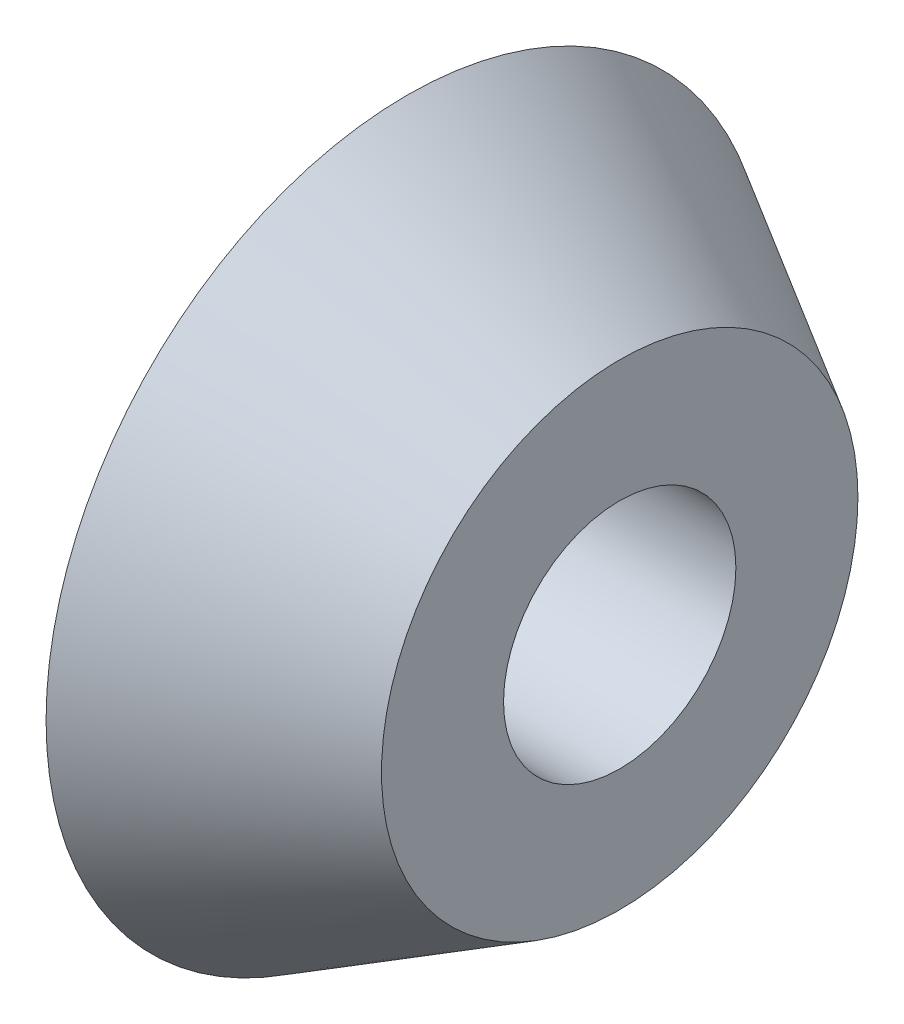
ISO-10303-21;
HEADER;
FILE_DESCRIPTION(('STEP AP214'),'2;1');
FILE_NAME('part.step','',(''),(''),'','','');
FILE_SCHEMA(('AUTOMOTIVE_DESIGN { 1 0 10303 214 1 1 1 1 }'));
ENDSEC;
DATA;
#1=APPLICATION_CONTEXT('core data for automotive mechanical design processes');
#2=APPLICATION_PROTOCOL_DEFINITION('international standard','automotive_design',2000,#1);
#3=PRODUCT_CONTEXT('',#1,'mechanical');
#4=PRODUCT('Part','Part','',(#3));
#5=PRODUCT_RELATED_PRODUCT_CATEGORY('part','',(#4));
#6=PRODUCT_DEFINITION_FORMATION('','',#4);
#7=PRODUCT_DEFINITION_CONTEXT('part definition',#1,'design');
#8=PRODUCT_DEFINITION('design','',#6,#7);
#9=PRODUCT_DEFINITION_SHAPE('','',#8);
#10=(LENGTH_UNIT() NAMED_UNIT(*) SI_UNIT(.MILLI.,.METRE.));
#11=(NAMED_UNIT(*) PLANE_ANGLE_UNIT() SI_UNIT($,.RADIAN.));
#12=(NAMED_UNIT(*) SI_UNIT($,.STERADIAN.) SOLID_ANGLE_UNIT());
#13=UNCERTAINTY_MEASURE_WITH_UNIT(LENGTH_MEASURE(1.E-05),#10,'distance_accuracy_value','');
#14=(GEOMETRIC_REPRESENTATION_CONTEXT(3) GLOBAL_UNCERTAINTY_ASSIGNED_CONTEXT((#13)) GLOBAL_UNIT_ASSIGNED_CONTEXT((#10,
#11,#12)) REPRESENTATION_CONTEXT('',''));
#15=CARTESIAN_POINT('',(0.,0.,0.));
#16=DIRECTION('',(0.,0.,1.));
#17=DIRECTION('',(1.,0.,0.));
#18=AXIS2_PLACEMENT_3D('',#15,#16,#17);
#19=CARTESIAN_POINT('',(4.41320981879205,15.494,0.));
#20=DIRECTION('',(1.,0.,0.));
#21=DIRECTION('',(0.,0.,1.));
#22=AXIS2_PLACEMENT_3D('',#19,#20,#21);
#23=PLANE('',#22);
#24=CARTESIAN_POINT('',(4.41320981879205,0.,0.));
#25=DIRECTION('',(1.,0.,0.));
#26=DIRECTION('',(0.,0.,-1.));
#27=AXIS2_PLACEMENT_3D('',#24,#25,#26);
#28=CIRCLE('',#27,8.0518);
#29=CARTESIAN_POINT('',(4.41320981879205,0.,-8.0518));
#30=VERTEX_POINT('',#29);
#31=EDGE_CURVE('E10',#30,#30,#28,.T.);
#32=ORIENTED_EDGE('',*,*,#31,.T.);
#33=EDGE_LOOP('',(#32));
#34=FACE_BOUND('',#33,.T.);
#35=CARTESIAN_POINT('',(4.41320981879205,0.,0.));
#36=DIRECTION('',(1.,0.,0.));
#37=DIRECTION('',(0.,0.,-1.));
#38=AXIS2_PLACEMENT_3D('',#35,#36,#37);
#39=CIRCLE('',#38,15.494);
#40=CARTESIAN_POINT('',(4.41320981879205,0.,-15.494));
#41=VERTEX_POINT('',#40);
#42=EDGE_CURVE('E57',#41,#41,#39,.T.);
#43=ORIENTED_EDGE('',*,*,#42,.F.);
#44=EDGE_LOOP('',(#43));
#45=FACE_BOUND('',#44,.T.);
#46=ADVANCED_FACE('F32',(#34,#45),#23,.F.);
#47=CARTESIAN_POINT('',(0.,0.,0.));
#48=DIRECTION('',(-1.,0.,0.));
#49=DIRECTION('',(0.,0.,-1.));
#50=AXIS2_PLACEMENT_3D('',#47,#48,#49);
#51=CYLINDRICAL_SURFACE('',#50,8.0518);
#52=CARTESIAN_POINT('',(25.5012301403958,0.,0.));
#53=DIRECTION('',(1.,0.,0.));
#54=DIRECTION('',(0.,0.,-1.));
#55=AXIS2_PLACEMENT_3D('',#52,#53,#54);
#56=CIRCLE('',#55,8.0518);
#57=CARTESIAN_POINT('',(25.5012301403958,0.,-8.0518));
#58=VERTEX_POINT('',#57);
#59=EDGE_CURVE('E38',#58,#58,#56,.T.);
#60=ORIENTED_EDGE('',*,*,#59,.T.);
#61=EDGE_LOOP('',(#60));
#62=FACE_BOUND('',#61,.T.);
#63=ORIENTED_EDGE('',*,*,#31,.F.);
#64=EDGE_LOOP('',(#63));
#65=FACE_BOUND('',#64,.T.);
#66=ADVANCED_FACE('F65',(#62,#65),#51,.F.);
#67=CARTESIAN_POINT('',(25.5012301403958,8.0518,0.));
#68=DIRECTION('',(-1.,0.,0.));
#69=DIRECTION('',(0.,0.,-1.));
#70=AXIS2_PLACEMENT_3D('',#67,#68,#69);
#71=PLANE('',#70);
#72=CARTESIAN_POINT('',(25.5012301403958,0.,0.));
#73=DIRECTION('',(1.,0.,0.));
#74=DIRECTION('',(0.,0.,-1.));
#75=AXIS2_PLACEMENT_3D('',#72,#73,#74);
#76=CIRCLE('',#75,16.51);
#77=CARTESIAN_POINT('',(25.5012301403958,0.,-16.51));
#78=VERTEX_POINT('',#77);
#79=EDGE_CURVE('E42',#78,#78,#76,.T.);
#80=ORIENTED_EDGE('',*,*,#79,.T.);
#81=EDGE_LOOP('',(#80));
#82=FACE_BOUND('',#81,.T.);
#83=ORIENTED_EDGE('',*,*,#59,.F.);
#84=EDGE_LOOP('',(#83));
#85=FACE_BOUND('',#84,.T.);
#86=ADVANCED_FACE('F69',(#82,#85),#71,.F.);
#87=CARTESIAN_POINT('',(25.5012301403958,0.,0.));
#88=DIRECTION('',(-1.,0.,0.));
#89=DIRECTION('',(0.,0.,-1.));
#90=AXIS2_PLACEMENT_3D('',#87,#88,#89);
#91=CONICAL_SURFACE('',#90,16.51,0.523598775598293);
#92=CARTESIAN_POINT('',(10.763209818792,0.,0.));
#93=DIRECTION('',(1.,0.,0.));
#94=DIRECTION('',(0.,0.,-1.));
#95=AXIS2_PLACEMENT_3D('',#92,#93,#94);
#96=CIRCLE('',#95,25.019);
#97=CARTESIAN_POINT('',(10.763209818792,0.,-25.019));
#98=VERTEX_POINT('',#97);
#99=EDGE_CURVE('E46',#98,#98,#96,.T.);
#100=ORIENTED_EDGE('',*,*,#99,.T.);
#101=EDGE_LOOP('',(#100));
#102=FACE_BOUND('',#101,.T.);
#103=ORIENTED_EDGE('',*,*,#79,.F.);
#104=EDGE_LOOP('',(#103));
#105=FACE_BOUND('',#104,.T.);
#106=ADVANCED_FACE('F73',(#102,#105),#91,.T.);
#107=CARTESIAN_POINT('',(10.763209818792,25.019,0.));
#108=DIRECTION('',(1.,0.,0.));
#109=DIRECTION('',(0.,0.,1.));
#110=AXIS2_PLACEMENT_3D('',#107,#108,#109);
#111=PLANE('',#110);
#112=CARTESIAN_POINT('',(10.763209818792,0.,0.));
#113=DIRECTION('',(1.,0.,0.));
#114=DIRECTION('',(0.,0.,-1.));
#115=AXIS2_PLACEMENT_3D('',#112,#113,#114);
#116=CIRCLE('',#115,16.51);
#117=CARTESIAN_POINT('',(10.763209818792,0.,-16.51));
#118=VERTEX_POINT('',#117);
#119=EDGE_CURVE('E51',#118,#118,#116,.T.);
#120=ORIENTED_EDGE('',*,*,#119,.T.);
#121=EDGE_LOOP('',(#120));
#122=FACE_BOUND('',#121,.T.);
#123=ORIENTED_EDGE('',*,*,#99,.F.);
#124=EDGE_LOOP('',(#123));
#125=FACE_BOUND('',#124,.T.);
#126=ADVANCED_FACE('F80',(#122,#125),#111,.F.);
#127=CARTESIAN_POINT('',(10.763209818792,0.,0.));
#128=DIRECTION('',(1.,0.,0.));
#129=DIRECTION('',(0.,0.,1.));
#130=AXIS2_PLACEMENT_3D('',#127,#128,#129);
#131=CONICAL_SURFACE('',#130,16.51,0.785398163397448);
#132=CARTESIAN_POINT('',(9.74720981879205,0.,0.));
#133=DIRECTION('',(1.,0.,0.));
#134=DIRECTION('',(0.,0.,-1.));
#135=AXIS2_PLACEMENT_3D('',#132,#133,#134);
#136=CIRCLE('',#135,15.494);
#137=CARTESIAN_POINT('',(9.74720981879205,0.,-15.494));
#138=VERTEX_POINT('',#137);
#139=EDGE_CURVE('E54',#138,#138,#136,.T.);
#140=ORIENTED_EDGE('',*,*,#139,.T.);
#141=EDGE_LOOP('',(#140));
#142=FACE_BOUND('',#141,.T.);
#143=ORIENTED_EDGE('',*,*,#119,.F.);
#144=EDGE_LOOP('',(#143));
#145=FACE_BOUND('',#144,.T.);
#146=ADVANCED_FACE('F84',(#142,#145),#131,.T.);
#147=CARTESIAN_POINT('',(0.,0.,0.));
#148=DIRECTION('',(-1.,0.,0.));
#149=DIRECTION('',(0.,0.,-1.));
#150=AXIS2_PLACEMENT_3D('',#147,#148,#149);
#151=CYLINDRICAL_SURFACE('',#150,15.494);
#152=ORIENTED_EDGE('',*,*,#42,.T.);
#153=EDGE_LOOP('',(#152));
#154=FACE_BOUND('',#153,.T.);
#155=ORIENTED_EDGE('',*,*,#139,.F.);
#156=EDGE_LOOP('',(#155));
#157=FACE_BOUND('',#156,.T.);
#158=ADVANCED_FACE('F61',(#154,#157),#151,.T.);
#159=CLOSED_SHELL('',(#46,#66,#86,#106,#126,#146,#158));
#160=MANIFOLD_SOLID_BREP('B2',#159);
#161=ADVANCED_BREP_SHAPE_REPRESENTATION('',(#18,#160),#14);
#162=SHAPE_DEFINITION_REPRESENTATION(#9,#161);
ENDSEC;
END-ISO-10303-21;
